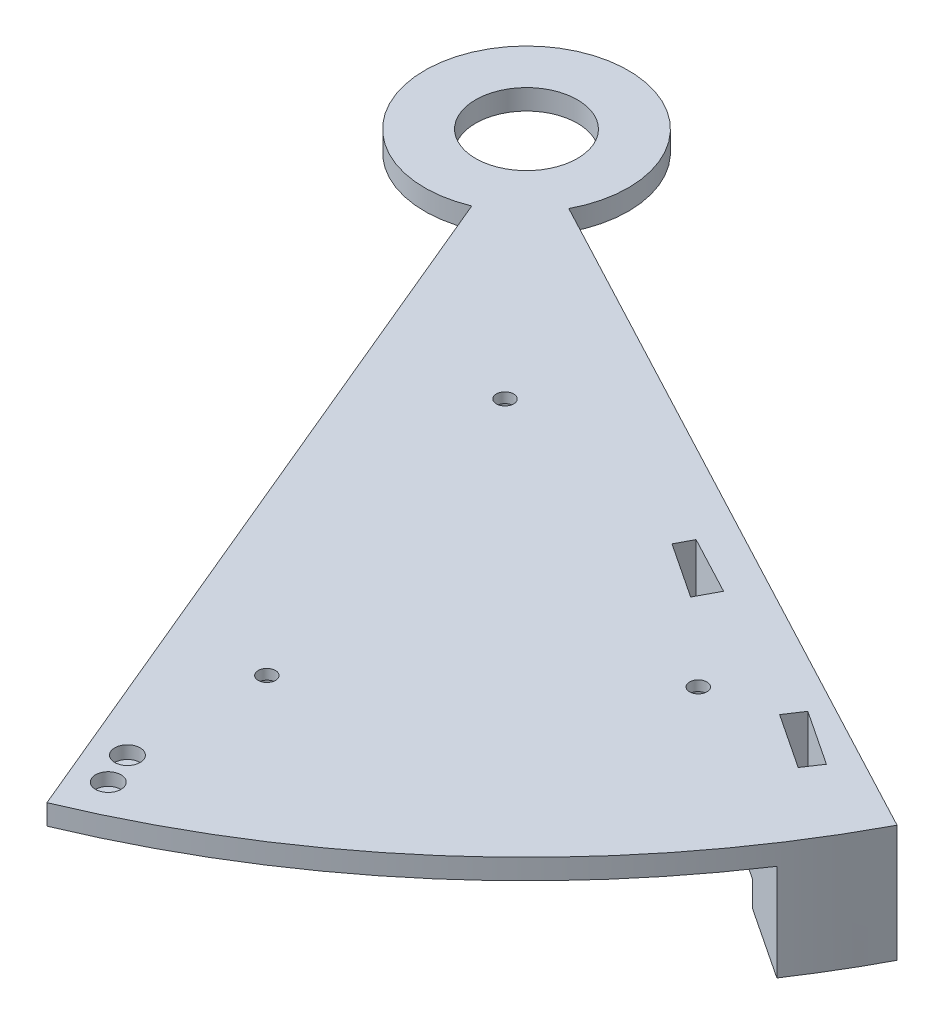
ISO-10303-21;
HEADER;
FILE_DESCRIPTION(('STEP AP214'),'2;1');
FILE_NAME('part.step','',(''),(''),'','','');
FILE_SCHEMA(('AUTOMOTIVE_DESIGN { 1 0 10303 214 1 1 1 1 }'));
ENDSEC;
DATA;
#1=APPLICATION_CONTEXT('core data for automotive mechanical design processes');
#2=APPLICATION_PROTOCOL_DEFINITION('international standard','automotive_design',2000,#1);
#3=PRODUCT_CONTEXT('',#1,'mechanical');
#4=PRODUCT('Part','Part','',(#3));
#5=PRODUCT_RELATED_PRODUCT_CATEGORY('part','',(#4));
#6=PRODUCT_DEFINITION_FORMATION('','',#4);
#7=PRODUCT_DEFINITION_CONTEXT('part definition',#1,'design');
#8=PRODUCT_DEFINITION('design','',#6,#7);
#9=PRODUCT_DEFINITION_SHAPE('','',#8);
#10=(LENGTH_UNIT() NAMED_UNIT(*) SI_UNIT(.MILLI.,.METRE.));
#11=(NAMED_UNIT(*) PLANE_ANGLE_UNIT() SI_UNIT($,.RADIAN.));
#12=(NAMED_UNIT(*) SI_UNIT($,.STERADIAN.) SOLID_ANGLE_UNIT());
#13=UNCERTAINTY_MEASURE_WITH_UNIT(LENGTH_MEASURE(1.E-05),#10,'distance_accuracy_value','');
#14=(GEOMETRIC_REPRESENTATION_CONTEXT(3) GLOBAL_UNCERTAINTY_ASSIGNED_CONTEXT((#13)) GLOBAL_UNIT_ASSIGNED_CONTEXT((#10,
#11,#12)) REPRESENTATION_CONTEXT('',''));
#15=CARTESIAN_POINT('',(0.,0.,0.));
#16=DIRECTION('',(0.,0.,1.));
#17=DIRECTION('',(1.,0.,0.));
#18=AXIS2_PLACEMENT_3D('',#15,#16,#17);
#19=CARTESIAN_POINT('',(0.,-19.,0.));
#20=DIRECTION('',(0.,-1.,0.));
#21=DIRECTION('',(0.,0.,-1.));
#22=AXIS2_PLACEMENT_3D('',#19,#20,#21);
#23=PLANE('',#22);
#24=DIRECTION('',(0.833392984477163,0.,0.552680860374455));
#25=VECTOR('',#24,1.);
#26=CARTESIAN_POINT('',(5.80314903393181,-19.,-8.75062633701025));
#27=LINE('',#26,#25);
#28=CARTESIAN_POINT('',(126.70883079196,-19.,71.430341661069));
#29=VERTEX_POINT('',#28);
#30=CARTESIAN_POINT('',(137.542939590163,-19.,78.6151928459368));
#31=VERTEX_POINT('',#30);
#32=EDGE_CURVE('E205',#29,#31,#27,.T.);
#33=ORIENTED_EDGE('',*,*,#32,.F.);
#34=DIRECTION('',(0.552680860374454,0.,-0.833392984477163));
#35=VECTOR('',#34,1.);
#36=CARTESIAN_POINT('',(120.905681758028,-19.,80.1809679980791));
#37=LINE('',#36,#35);
#38=CARTESIAN_POINT('',(120.905681758028,-19.,80.1809679980791));
#39=VERTEX_POINT('',#38);
#40=EDGE_CURVE('E188',#39,#29,#37,.T.);
#41=ORIENTED_EDGE('',*,*,#40,.F.);
#42=DIRECTION('',(0.833392984477163,0.,0.552680860374455));
#43=VECTOR('',#42,1.);
#44=CARTESIAN_POINT('',(0.,-19.,0.));
#45=LINE('',#44,#43);
#46=CARTESIAN_POINT('',(95.7592429864337,-19.,63.5046152155351));
#47=VERTEX_POINT('',#46);
#48=EDGE_CURVE('E370',#47,#39,#45,.T.);
#49=ORIENTED_EDGE('',*,*,#48,.F.);
#50=DIRECTION('',(-0.468176170110818,0.,0.883635147411174));
#51=VECTOR('',#50,1.);
#52=CARTESIAN_POINT('',(101.041540999482,-19.,53.5348122195286));
#53=LINE('',#52,#51);
#54=CARTESIAN_POINT('',(101.041540999482,-19.,53.5348122195284));
#55=VERTEX_POINT('',#54);
#56=EDGE_CURVE('E265',#55,#47,#53,.T.);
#57=ORIENTED_EDGE('',*,*,#56,.F.);
#58=DIRECTION('',(0.883635147411175,0.,0.468176170110816));
#59=VECTOR('',#58,1.);
#60=CARTESIAN_POINT('',(0.,-19.,0.));
#61=LINE('',#60,#59);
#62=CARTESIAN_POINT('',(154.857059583808,-19.,82.0478738119205));
#63=VERTEX_POINT('',#62);
#64=EDGE_CURVE('E354',#55,#63,#61,.T.);
#65=ORIENTED_EDGE('',*,*,#64,.T.);
#66=CARTESIAN_POINT('',(0.,-19.,0.));
#67=DIRECTION('',(0.,-1.,0.));
#68=DIRECTION('',(0.,0.,-1.));
#69=AXIS2_PLACEMENT_3D('',#66,#67,#68);
#70=CIRCLE('',#69,175.25);
#71=CARTESIAN_POINT('',(146.052120529623,-19.,96.8573207806232));
#72=VERTEX_POINT('',#71);
#73=EDGE_CURVE('E360',#63,#72,#70,.T.);
#74=ORIENTED_EDGE('',*,*,#73,.T.);
#75=CARTESIAN_POINT('',(131.739790556231,-19.,87.3658191829471));
#76=VERTEX_POINT('',#75);
#77=EDGE_CURVE('E364',#76,#72,#45,.T.);
#78=ORIENTED_EDGE('',*,*,#77,.F.);
#79=DIRECTION('',(0.552680860374456,0.,-0.833392984477162));
#80=VECTOR('',#79,1.);
#81=CARTESIAN_POINT('',(131.739790556231,-19.,87.3658191829473));
#82=LINE('',#81,#80);
#83=EDGE_CURVE('E217',#76,#31,#82,.T.);
#84=ORIENTED_EDGE('',*,*,#83,.T.);
#85=EDGE_LOOP('',(#33,#41,#49,#57,#65,#74,#78,#84));
#86=FACE_BOUND('',#85,.T.);
#87=ADVANCED_FACE('F41',(#86),#23,.T.);
#88=CARTESIAN_POINT('',(-3.04314510572033,4.,5.7436284581727));
#89=DIRECTION('',(0.468176170110815,0.,-0.883635147411175));
#90=DIRECTION('',(-0.883635147411175,0.,-0.468176170110815));
#91=AXIS2_PLACEMENT_3D('',#88,#89,#90);
#92=PLANE('',#91);
#93=DIRECTION('',(0.883635147411175,0.,0.468176170110815));
#94=VECTOR('',#93,1.);
#95=CARTESIAN_POINT('',(-3.04314510572033,-14.,5.7436284581727));
#96=LINE('',#95,#94);
#97=CARTESIAN_POINT('',(86.5111389774166,-14.,53.1921504662605));
#98=VERTEX_POINT('',#97);
#99=CARTESIAN_POINT('',(97.9983958937618,-14.,59.278440677701));
#100=VERTEX_POINT('',#99);
#101=EDGE_CURVE('E243',#98,#100,#96,.T.);
#102=ORIENTED_EDGE('',*,*,#101,.T.);
#103=DIRECTION('',(0.,-1.,0.));
#104=VECTOR('',#103,1.);
#105=CARTESIAN_POINT('',(97.9983958937618,4.,59.278440677701));
#106=LINE('',#105,#104);
#107=CARTESIAN_POINT('',(97.9983958937618,4.,59.278440677701));
#108=VERTEX_POINT('',#107);
#109=EDGE_CURVE('E291',#108,#100,#106,.T.);
#110=ORIENTED_EDGE('',*,*,#109,.F.);
#111=DIRECTION('',(0.883635147411175,0.,0.468176170110815));
#112=VECTOR('',#111,1.);
#113=CARTESIAN_POINT('',(-3.04314510572033,4.,5.7436284581727));
#114=LINE('',#113,#112);
#115=CARTESIAN_POINT('',(86.5111389774166,4.,53.1921504662605));
#116=VERTEX_POINT('',#115);
#117=EDGE_CURVE('E282',#116,#108,#114,.T.);
#118=ORIENTED_EDGE('',*,*,#117,.F.);
#119=DIRECTION('',(0.,-1.,0.));
#120=VECTOR('',#119,1.);
#121=CARTESIAN_POINT('',(86.5111389774166,4.,53.1921504662605));
#122=LINE('',#121,#120);
#123=EDGE_CURVE('E296',#116,#98,#122,.T.);
#124=ORIENTED_EDGE('',*,*,#123,.T.);
#125=EDGE_LOOP('',(#102,#110,#118,#124));
#126=FACE_BOUND('',#125,.T.);
#127=ADVANCED_FACE('F487',(#126),#92,.F.);
#128=CARTESIAN_POINT('',(0.,-19.,0.));
#129=DIRECTION('',(-0.552680860374455,0.,0.833392984477163));
#130=DIRECTION('',(0.833392984477163,0.,0.552680860374455));
#131=AXIS2_PLACEMENT_3D('',#128,#129,#130);
#132=PLANE('',#131);
#133=DIRECTION('',(0.,-1.,0.));
#134=VECTOR('',#133,1.);
#135=CARTESIAN_POINT('',(120.905681758028,-14.,80.1809679980791));
#136=LINE('',#135,#134);
#137=CARTESIAN_POINT('',(120.905681758028,-14.,80.1809679980791));
#138=VERTEX_POINT('',#137);
#139=EDGE_CURVE('E240',#138,#39,#136,.T.);
#140=ORIENTED_EDGE('',*,*,#139,.F.);
#141=DIRECTION('',(-0.833392984477163,0.,-0.552680860374455));
#142=VECTOR('',#141,1.);
#143=CARTESIAN_POINT('',(0.,-14.,0.));
#144=LINE('',#143,#142);
#145=CARTESIAN_POINT('',(131.739790556231,-14.,87.365819182947));
#146=VERTEX_POINT('',#145);
#147=EDGE_CURVE('E228',#146,#138,#144,.T.);
#148=ORIENTED_EDGE('',*,*,#147,.F.);
#149=DIRECTION('',(0.,-1.,0.));
#150=VECTOR('',#149,1.);
#151=CARTESIAN_POINT('',(131.739790556231,-14.,87.3658191829471));
#152=LINE('',#151,#150);
#153=EDGE_CURVE('E235',#146,#76,#152,.T.);
#154=ORIENTED_EDGE('',*,*,#153,.T.);
#155=ORIENTED_EDGE('',*,*,#77,.T.);
#156=DIRECTION('',(0.,1.,0.));
#157=VECTOR('',#156,1.);
#158=CARTESIAN_POINT('',(146.052120529623,-19.,96.8573207806232));
#159=LINE('',#158,#157);
#160=CARTESIAN_POINT('',(146.052120529623,0.,96.8573207806232));
#161=VERTEX_POINT('',#160);
#162=EDGE_CURVE('E380',#72,#161,#159,.T.);
#163=ORIENTED_EDGE('',*,*,#162,.T.);
#164=DIRECTION('',(0.833392984477163,0.,0.552680860374455));
#165=VECTOR('',#164,1.);
#166=CARTESIAN_POINT('',(0.,0.,0.));
#167=LINE('',#166,#165);
#168=CARTESIAN_POINT('',(95.7592429864337,0.,63.5046152155351));
#169=VERTEX_POINT('',#168);
#170=EDGE_CURVE('E374',#169,#161,#167,.T.);
#171=ORIENTED_EDGE('',*,*,#170,.F.);
#172=DIRECTION('',(0.,-1.,0.));
#173=VECTOR('',#172,1.);
#174=CARTESIAN_POINT('',(95.7592429864337,4.,63.5046152155351));
#175=LINE('',#174,#173);
#176=EDGE_CURVE('E286',#169,#47,#175,.T.);
#177=ORIENTED_EDGE('',*,*,#176,.T.);
#178=ORIENTED_EDGE('',*,*,#48,.T.);
#179=EDGE_LOOP('',(#140,#148,#154,#155,#163,#171,#177,#178));
#180=FACE_BOUND('',#179,.T.);
#181=ADVANCED_FACE('F477',(#180),#132,.T.);
#182=CARTESIAN_POINT('',(67.4644149722506,10.,118.480178563555));
#183=DIRECTION('',(0.,-1.,0.));
#184=DIRECTION('',(0.,0.,-1.));
#185=AXIS2_PLACEMENT_3D('',#182,#183,#184);
#186=CYLINDRICAL_SURFACE('',#185,1.7);
#187=CARTESIAN_POINT('',(67.4644149722506,4.,118.480178563555));
#188=DIRECTION('',(0.,1.,0.));
#189=DIRECTION('',(0.,0.,1.));
#190=AXIS2_PLACEMENT_3D('',#187,#188,#189);
#191=CIRCLE('',#190,1.7);
#192=CARTESIAN_POINT('',(67.4644149722506,4.,120.180178563555));
#193=VERTEX_POINT('',#192);
#194=EDGE_CURVE('E337',#193,#193,#191,.T.);
#195=ORIENTED_EDGE('',*,*,#194,.T.);
#196=EDGE_LOOP('',(#195));
#197=FACE_BOUND('',#196,.T.);
#198=CARTESIAN_POINT('',(67.4644149722506,2.,118.480178563555));
#199=DIRECTION('',(0.,-1.,0.));
#200=DIRECTION('',(0.,0.,-1.));
#201=AXIS2_PLACEMENT_3D('',#198,#199,#200);
#202=CIRCLE('',#201,1.7);
#203=CARTESIAN_POINT('',(67.4644149722506,2.,116.780178563555));
#204=VERTEX_POINT('',#203);
#205=EDGE_CURVE('E45',#204,#204,#202,.F.);
#206=ORIENTED_EDGE('',*,*,#205,.F.);
#207=EDGE_LOOP('',(#206));
#208=FACE_BOUND('',#207,.T.);
#209=ADVANCED_FACE('F474',(#197,#208),#186,.F.);
#210=CARTESIAN_POINT('',(111.793635370719,10.,78.0460318696525));
#211=DIRECTION('',(0.,-1.,0.));
#212=DIRECTION('',(0.,0.,-1.));
#213=AXIS2_PLACEMENT_3D('',#210,#211,#212);
#214=CYLINDRICAL_SURFACE('',#213,1.7);
#215=CARTESIAN_POINT('',(111.793635370719,4.,78.0460318696525));
#216=DIRECTION('',(0.,1.,0.));
#217=DIRECTION('',(0.,0.,1.));
#218=AXIS2_PLACEMENT_3D('',#215,#216,#217);
#219=CIRCLE('',#218,1.7);
#220=CARTESIAN_POINT('',(111.793635370719,4.,79.7460318696525));
#221=VERTEX_POINT('',#220);
#222=EDGE_CURVE('E341',#221,#221,#219,.T.);
#223=ORIENTED_EDGE('',*,*,#222,.T.);
#224=EDGE_LOOP('',(#223));
#225=FACE_BOUND('',#224,.T.);
#226=CARTESIAN_POINT('',(111.793635370719,2.,78.0460318696525));
#227=DIRECTION('',(0.,-1.,0.));
#228=DIRECTION('',(0.,0.,-1.));
#229=AXIS2_PLACEMENT_3D('',#226,#227,#228);
#230=CIRCLE('',#229,1.7);
#231=CARTESIAN_POINT('',(111.793635370719,2.,76.3460318696525));
#232=VERTEX_POINT('',#231);
#233=EDGE_CURVE('E463',#232,#232,#230,.F.);
#234=ORIENTED_EDGE('',*,*,#233,.F.);
#235=EDGE_LOOP('',(#234));
#236=FACE_BOUND('',#235,.T.);
#237=ADVANCED_FACE('F476',(#225,#236),#214,.F.);
#238=CARTESIAN_POINT('',(43.8036589183947,10.,48.0233220983403));
#239=DIRECTION('',(0.,-1.,0.));
#240=DIRECTION('',(0.,0.,-1.));
#241=AXIS2_PLACEMENT_3D('',#238,#239,#240);
#242=CYLINDRICAL_SURFACE('',#241,1.7);
#243=CARTESIAN_POINT('',(43.8036589183947,4.,48.0233220983403));
#244=DIRECTION('',(0.,1.,0.));
#245=DIRECTION('',(0.,0.,1.));
#246=AXIS2_PLACEMENT_3D('',#243,#244,#245);
#247=CIRCLE('',#246,1.7);
#248=CARTESIAN_POINT('',(43.8036589183947,4.,49.7233220983403));
#249=VERTEX_POINT('',#248);
#250=EDGE_CURVE('E345',#249,#249,#247,.T.);
#251=ORIENTED_EDGE('',*,*,#250,.T.);
#252=EDGE_LOOP('',(#251));
#253=FACE_BOUND('',#252,.T.);
#254=CARTESIAN_POINT('',(43.8036589183947,2.,48.0233220983403));
#255=DIRECTION('',(0.,-1.,0.));
#256=DIRECTION('',(0.,0.,-1.));
#257=AXIS2_PLACEMENT_3D('',#254,#255,#256);
#258=CIRCLE('',#257,1.7);
#259=CARTESIAN_POINT('',(43.8036589183947,2.,46.3233220983403));
#260=VERTEX_POINT('',#259);
#261=EDGE_CURVE('E317',#260,#260,#258,.F.);
#262=ORIENTED_EDGE('',*,*,#261,.F.);
#263=EDGE_LOOP('',(#262));
#264=FACE_BOUND('',#263,.T.);
#265=ADVANCED_FACE('F484',(#253,#264),#242,.F.);
#266=CARTESIAN_POINT('',(0.,4.,0.));
#267=DIRECTION('',(0.,-1.,0.));
#268=DIRECTION('',(0.,0.,-1.));
#269=AXIS2_PLACEMENT_3D('',#266,#267,#268);
#270=CYLINDRICAL_SURFACE('',#269,175.25);
#271=CARTESIAN_POINT('',(0.,0.,0.));
#272=DIRECTION('',(0.,1.,0.));
#273=DIRECTION('',(0.,0.,1.));
#274=AXIS2_PLACEMENT_3D('',#271,#272,#273);
#275=CIRCLE('',#274,175.25);
#276=CARTESIAN_POINT('',(67.5000025728551,0.,161.729132046965));
#277=VERTEX_POINT('',#276);
#278=EDGE_CURVE('E408',#277,#161,#275,.T.);
#279=ORIENTED_EDGE('',*,*,#278,.T.);
#280=ORIENTED_EDGE('',*,*,#162,.F.);
#281=ORIENTED_EDGE('',*,*,#73,.F.);
#282=DIRECTION('',(0.,-1.,0.));
#283=VECTOR('',#282,1.);
#284=CARTESIAN_POINT('',(154.857059583808,4.,82.0478738119205));
#285=LINE('',#284,#283);
#286=CARTESIAN_POINT('',(154.857059583808,4.,82.0478738119205));
#287=VERTEX_POINT('',#286);
#288=EDGE_CURVE('E11',#287,#63,#285,.T.);
#289=ORIENTED_EDGE('',*,*,#288,.F.);
#290=CARTESIAN_POINT('',(0.,4.,0.));
#291=DIRECTION('',(0.,1.,0.));
#292=DIRECTION('',(0.,0.,1.));
#293=AXIS2_PLACEMENT_3D('',#290,#291,#292);
#294=CIRCLE('',#293,175.25);
#295=CARTESIAN_POINT('',(67.5000025728551,4.,161.729132046965));
#296=VERTEX_POINT('',#295);
#297=EDGE_CURVE('E422',#296,#287,#294,.T.);
#298=ORIENTED_EDGE('',*,*,#297,.F.);
#299=DIRECTION('',(0.,-1.,0.));
#300=VECTOR('',#299,1.);
#301=CARTESIAN_POINT('',(67.5000025728551,4.,161.729132046965));
#302=LINE('',#301,#300);
#303=EDGE_CURVE('E436',#296,#277,#302,.T.);
#304=ORIENTED_EDGE('',*,*,#303,.T.);
#305=EDGE_LOOP('',(#279,#280,#281,#289,#298,#304));
#306=FACE_BOUND('',#305,.T.);
#307=ADVANCED_FACE('F43',(#306),#270,.T.);
#308=CARTESIAN_POINT('',(17.6727029482235,4.,9.36352340221632));
#309=DIRECTION('',(-0.468176170110816,0.,0.883635147411175));
#310=DIRECTION('',(0.883635147411175,0.,0.468176170110816));
#311=AXIS2_PLACEMENT_3D('',#308,#309,#310);
#312=PLANE('',#311);
#313=ORIENTED_EDGE('',*,*,#64,.F.);
#314=DIRECTION('',(0.,-1.,0.));
#315=VECTOR('',#314,1.);
#316=CARTESIAN_POINT('',(101.041540999482,-14.,53.5348122195284));
#317=LINE('',#316,#315);
#318=CARTESIAN_POINT('',(101.041540999482,-14.,53.5348122195284));
#319=VERTEX_POINT('',#318);
#320=EDGE_CURVE('E261',#319,#55,#317,.T.);
#321=ORIENTED_EDGE('',*,*,#320,.F.);
#322=DIRECTION('',(0.883635147411175,0.,0.468176170110816));
#323=VECTOR('',#322,1.);
#324=CARTESIAN_POINT('',(0.,-14.,0.));
#325=LINE('',#324,#323);
#326=CARTESIAN_POINT('',(89.5542840831369,-14.,47.4485220080878));
#327=VERTEX_POINT('',#326);
#328=EDGE_CURVE('E254',#327,#319,#325,.T.);
#329=ORIENTED_EDGE('',*,*,#328,.F.);
#330=DIRECTION('',(0.,-1.,0.));
#331=VECTOR('',#330,1.);
#332=CARTESIAN_POINT('',(89.5542840831369,-14.,47.4485220080878));
#333=LINE('',#332,#331);
#334=CARTESIAN_POINT('',(89.5542840831369,-19.,47.4485220080878));
#335=VERTEX_POINT('',#334);
#336=EDGE_CURVE('E260',#327,#335,#333,.T.);
#337=ORIENTED_EDGE('',*,*,#336,.T.);
#338=CARTESIAN_POINT('',(17.6727029482235,-19.,9.36352340221632));
#339=VERTEX_POINT('',#338);
#340=EDGE_CURVE('E356',#339,#335,#61,.T.);
#341=ORIENTED_EDGE('',*,*,#340,.F.);
#342=DIRECTION('',(0.,1.,0.));
#343=VECTOR('',#342,1.);
#344=CARTESIAN_POINT('',(17.6727029482235,-19.,9.36352340221632));
#345=LINE('',#344,#343);
#346=CARTESIAN_POINT('',(17.6727029482235,0.,9.36352340221632));
#347=VERTEX_POINT('',#346);
#348=EDGE_CURVE('E384',#339,#347,#345,.T.);
#349=ORIENTED_EDGE('',*,*,#348,.T.);
#350=DIRECTION('',(0.,-1.,0.));
#351=VECTOR('',#350,1.);
#352=CARTESIAN_POINT('',(17.6727029482235,4.,9.36352340221632));
#353=LINE('',#352,#351);
#354=CARTESIAN_POINT('',(17.6727029482235,4.,9.36352340221632));
#355=VERTEX_POINT('',#354);
#356=EDGE_CURVE('E51',#355,#347,#353,.T.);
#357=ORIENTED_EDGE('',*,*,#356,.F.);
#358=DIRECTION('',(-0.883635147411175,0.,-0.468176170110816));
#359=VECTOR('',#358,1.);
#360=CARTESIAN_POINT('',(17.6727029482235,4.,9.36352340221632));
#361=LINE('',#360,#359);
#362=EDGE_CURVE('E426',#287,#355,#361,.T.);
#363=ORIENTED_EDGE('',*,*,#362,.F.);
#364=ORIENTED_EDGE('',*,*,#288,.T.);
#365=EDGE_LOOP('',(#313,#321,#329,#337,#341,#349,#357,#363,#364));
#366=FACE_BOUND('',#365,.T.);
#367=ADVANCED_FACE('F519',(#366),#312,.F.);
#368=CARTESIAN_POINT('',(0.,4.,0.));
#369=DIRECTION('',(0.,-1.,0.));
#370=DIRECTION('',(0.,0.,-1.));
#371=AXIS2_PLACEMENT_3D('',#368,#369,#370);
#372=CYLINDRICAL_SURFACE('',#371,20.);
#373=CARTESIAN_POINT('',(0.,0.,0.));
#374=DIRECTION('',(0.,1.,0.));
#375=DIRECTION('',(0.,0.,1.));
#376=AXIS2_PLACEMENT_3D('',#373,#374,#375);
#377=CIRCLE('',#376,20.);
#378=CARTESIAN_POINT('',(7.70328132072526,0.,18.4569622878134));
#379=VERTEX_POINT('',#378);
#380=EDGE_CURVE('E440',#347,#379,#377,.T.);
#381=ORIENTED_EDGE('',*,*,#380,.T.);
#382=DIRECTION('',(0.,-1.,0.));
#383=VECTOR('',#382,1.);
#384=CARTESIAN_POINT('',(7.70328132072526,4.,18.4569622878134));
#385=LINE('',#384,#383);
#386=CARTESIAN_POINT('',(7.70328132072526,4.,18.4569622878134));
#387=VERTEX_POINT('',#386);
#388=EDGE_CURVE('E448',#387,#379,#385,.T.);
#389=ORIENTED_EDGE('',*,*,#388,.F.);
#390=CARTESIAN_POINT('',(0.,4.,0.));
#391=DIRECTION('',(0.,1.,0.));
#392=DIRECTION('',(0.,0.,1.));
#393=AXIS2_PLACEMENT_3D('',#390,#391,#392);
#394=CIRCLE('',#393,20.);
#395=EDGE_CURVE('E430',#355,#387,#394,.T.);
#396=ORIENTED_EDGE('',*,*,#395,.F.);
#397=ORIENTED_EDGE('',*,*,#356,.T.);
#398=EDGE_LOOP('',(#381,#389,#396,#397));
#399=FACE_BOUND('',#398,.T.);
#400=ADVANCED_FACE('F557',(#399),#372,.T.);
#401=CARTESIAN_POINT('',(67.5000025728551,4.,161.729132046965));
#402=DIRECTION('',(0.922848114390669,0.,-0.385164066036263));
#403=DIRECTION('',(-0.385164066036263,0.,-0.922848114390669));
#404=AXIS2_PLACEMENT_3D('',#401,#402,#403);
#405=PLANE('',#404);
#406=DIRECTION('',(0.385164066036263,0.,0.922848114390669));
#407=VECTOR('',#406,1.);
#408=CARTESIAN_POINT('',(67.5000025728551,0.,161.729132046965));
#409=LINE('',#408,#407);
#410=EDGE_CURVE('E427',#379,#277,#409,.T.);
#411=ORIENTED_EDGE('',*,*,#410,.T.);
#412=ORIENTED_EDGE('',*,*,#303,.F.);
#413=DIRECTION('',(0.385164066036263,0.,0.922848114390669));
#414=VECTOR('',#413,1.);
#415=CARTESIAN_POINT('',(67.5000025728551,4.,161.729132046965));
#416=LINE('',#415,#414);
#417=EDGE_CURVE('E433',#387,#296,#416,.T.);
#418=ORIENTED_EDGE('',*,*,#417,.F.);
#419=ORIENTED_EDGE('',*,*,#388,.T.);
#420=EDGE_LOOP('',(#411,#412,#418,#419));
#421=FACE_BOUND('',#420,.T.);
#422=ADVANCED_FACE('F562',(#421),#405,.F.);
#423=CARTESIAN_POINT('',(0.,4.,0.));
#424=DIRECTION('',(0.,1.,0.));
#425=DIRECTION('',(0.,0.,1.));
#426=AXIS2_PLACEMENT_3D('',#423,#424,#425);
#427=PLANE('',#426);
#428=DIRECTION('',(0.552680860374453,0.,-0.833392984477164));
#429=VECTOR('',#428,1.);
#430=CARTESIAN_POINT('',(120.905681758028,4.,80.180967998079));
#431=LINE('',#430,#429);
#432=CARTESIAN_POINT('',(124.498107350462,4.,74.7639135989776));
#433=VERTEX_POINT('',#432);
#434=CARTESIAN_POINT('',(126.70883079196,4.,71.430341661069));
#435=VERTEX_POINT('',#434);
#436=EDGE_CURVE('E185',#433,#435,#431,.T.);
#437=ORIENTED_EDGE('',*,*,#436,.T.);
#438=DIRECTION('',(0.833392984477163,0.,0.552680860374455));
#439=VECTOR('',#438,1.);
#440=CARTESIAN_POINT('',(5.80314903393181,4.,-8.75062633701025));
#441=LINE('',#440,#439);
#442=CARTESIAN_POINT('',(137.542939590163,4.,78.6151928459368));
#443=VERTEX_POINT('',#442);
#444=EDGE_CURVE('E194',#435,#443,#441,.T.);
#445=ORIENTED_EDGE('',*,*,#444,.T.);
#446=DIRECTION('',(0.552680860374449,0.,-0.833392984477167));
#447=VECTOR('',#446,1.);
#448=CARTESIAN_POINT('',(131.739790556232,4.,87.3658191829461));
#449=LINE('',#448,#447);
#450=CARTESIAN_POINT('',(135.332216148665,4.,81.9487647838455));
#451=VERTEX_POINT('',#450);
#452=EDGE_CURVE('E199',#451,#443,#449,.T.);
#453=ORIENTED_EDGE('',*,*,#452,.F.);
#454=DIRECTION('',(-0.833392984477163,0.,-0.552680860374454));
#455=VECTOR('',#454,1.);
#456=CARTESIAN_POINT('',(3.59242559243389,4.,-5.41705439910147));
#457=LINE('',#456,#455);
#458=EDGE_CURVE('E191',#451,#433,#457,.T.);
#459=ORIENTED_EDGE('',*,*,#458,.T.);
#460=EDGE_LOOP('',(#437,#445,#453,#459));
#461=FACE_BOUND('',#460,.T.);
#462=DIRECTION('',(-0.468176170110818,0.,0.883635147411174));
#463=VECTOR('',#462,1.);
#464=CARTESIAN_POINT('',(101.041540999482,4.,53.5348122195286));
#465=LINE('',#464,#463);
#466=CARTESIAN_POINT('',(95.7592429864337,4.,63.5046152155351));
#467=VERTEX_POINT('',#466);
#468=EDGE_CURVE('E269',#108,#467,#465,.T.);
#469=ORIENTED_EDGE('',*,*,#468,.T.);
#470=DIRECTION('',(-0.833392984477163,0.,-0.552680860374455));
#471=VECTOR('',#470,1.);
#472=CARTESIAN_POINT('',(0.,4.,0.));
#473=LINE('',#472,#471);
#474=CARTESIAN_POINT('',(84.8725223820288,4.,56.2848734821996));
#475=VERTEX_POINT('',#474);
#476=EDGE_CURVE('E273',#467,#475,#473,.T.);
#477=ORIENTED_EDGE('',*,*,#476,.T.);
#478=DIRECTION('',(0.468176170110815,0.,-0.883635147411175));
#479=VECTOR('',#478,1.);
#480=CARTESIAN_POINT('',(89.554284083137,4.,47.4485220080877));
#481=LINE('',#480,#479);
#482=EDGE_CURVE('E278',#475,#116,#481,.T.);
#483=ORIENTED_EDGE('',*,*,#482,.T.);
#484=ORIENTED_EDGE('',*,*,#117,.T.);
#485=EDGE_LOOP('',(#469,#477,#483,#484));
#486=FACE_BOUND('',#485,.T.);
#487=ORIENTED_EDGE('',*,*,#250,.F.);
#488=EDGE_LOOP('',(#487));
#489=FACE_BOUND('',#488,.T.);
#490=ORIENTED_EDGE('',*,*,#222,.F.);
#491=EDGE_LOOP('',(#490));
#492=FACE_BOUND('',#491,.T.);
#493=ORIENTED_EDGE('',*,*,#194,.F.);
#494=EDGE_LOOP('',(#493));
#495=FACE_BOUND('',#494,.T.);
#496=CARTESIAN_POINT('',(0.,4.,0.));
#497=DIRECTION('',(0.,1.,0.));
#498=DIRECTION('',(0.,0.,1.));
#499=AXIS2_PLACEMENT_3D('',#496,#497,#498);
#500=CIRCLE('',#499,10.);
#501=CARTESIAN_POINT('',(0.,4.,10.));
#502=VERTEX_POINT('',#501);
#503=EDGE_CURVE('E387',#502,#502,#500,.T.);
#504=ORIENTED_EDGE('',*,*,#503,.F.);
#505=EDGE_LOOP('',(#504));
#506=FACE_BOUND('',#505,.T.);
#507=CARTESIAN_POINT('',(70.0252076744945,4.,152.20421114458));
#508=DIRECTION('',(0.,1.,0.));
#509=DIRECTION('',(0.,0.,-1.));
#510=AXIS2_PLACEMENT_3D('',#507,#508,#509);
#511=CIRCLE('',#510,2.49999999999998);
#512=CARTESIAN_POINT('',(70.0252076744945,4.,149.70421114458));
#513=VERTEX_POINT('',#512);
#514=EDGE_CURVE('E409',#513,#513,#511,.T.);
#515=ORIENTED_EDGE('',*,*,#514,.F.);
#516=EDGE_LOOP('',(#515));
#517=FACE_BOUND('',#516,.T.);
#518=CARTESIAN_POINT('',(67.3271757764404,4.,145.739984225223));
#519=DIRECTION('',(0.,1.,0.));
#520=DIRECTION('',(0.,0.,-1.));
#521=AXIS2_PLACEMENT_3D('',#518,#519,#520);
#522=CIRCLE('',#521,2.50000000000001);
#523=CARTESIAN_POINT('',(67.3271757764404,4.,143.239984225223));
#524=VERTEX_POINT('',#523);
#525=EDGE_CURVE('E417',#524,#524,#522,.T.);
#526=ORIENTED_EDGE('',*,*,#525,.F.);
#527=EDGE_LOOP('',(#526));
#528=FACE_BOUND('',#527,.T.);
#529=ORIENTED_EDGE('',*,*,#297,.T.);
#530=ORIENTED_EDGE('',*,*,#362,.T.);
#531=ORIENTED_EDGE('',*,*,#395,.T.);
#532=ORIENTED_EDGE('',*,*,#417,.T.);
#533=EDGE_LOOP('',(#529,#530,#531,#532));
#534=FACE_BOUND('',#533,.T.);
#535=ADVANCED_FACE('F201',(#461,#486,#489,#492,#495,#506,#517,#528,#534),#427,.T.);
#536=CARTESIAN_POINT('',(0.,0.,0.));
#537=DIRECTION('',(0.,1.,0.));
#538=DIRECTION('',(0.,0.,1.));
#539=AXIS2_PLACEMENT_3D('',#536,#537,#538);
#540=PLANE('',#539);
#541=CARTESIAN_POINT('',(111.793635370719,0.,78.0460318696525));
#542=DIRECTION('',(0.,-1.,0.));
#543=DIRECTION('',(0.,0.,-1.));
#544=AXIS2_PLACEMENT_3D('',#541,#542,#543);
#545=CIRCLE('',#544,3.00000000000001);
#546=CARTESIAN_POINT('',(111.793635370719,0.,75.0460318696525));
#547=VERTEX_POINT('',#546);
#548=EDGE_CURVE('E318',#547,#547,#545,.T.);
#549=ORIENTED_EDGE('',*,*,#548,.F.);
#550=EDGE_LOOP('',(#549));
#551=FACE_BOUND('',#550,.T.);
#552=CARTESIAN_POINT('',(43.8036589183947,0.,48.0233220983403));
#553=DIRECTION('',(0.,-1.,0.));
#554=DIRECTION('',(0.,0.,-1.));
#555=AXIS2_PLACEMENT_3D('',#552,#553,#554);
#556=CIRCLE('',#555,3.);
#557=CARTESIAN_POINT('',(43.8036589183947,0.,45.0233220983403));
#558=VERTEX_POINT('',#557);
#559=EDGE_CURVE('E326',#558,#558,#556,.T.);
#560=ORIENTED_EDGE('',*,*,#559,.F.);
#561=EDGE_LOOP('',(#560));
#562=FACE_BOUND('',#561,.T.);
#563=CARTESIAN_POINT('',(67.4644149722506,0.,118.480178563555));
#564=DIRECTION('',(0.,-1.,0.));
#565=DIRECTION('',(0.,0.,-1.));
#566=AXIS2_PLACEMENT_3D('',#563,#564,#565);
#567=CIRCLE('',#566,3.00000000000001);
#568=CARTESIAN_POINT('',(67.4644149722506,0.,115.480178563555));
#569=VERTEX_POINT('',#568);
#570=EDGE_CURVE('E312',#569,#569,#567,.T.);
#571=ORIENTED_EDGE('',*,*,#570,.F.);
#572=EDGE_LOOP('',(#571));
#573=FACE_BOUND('',#572,.T.);
#574=CARTESIAN_POINT('',(0.,0.,0.));
#575=DIRECTION('',(0.,1.,0.));
#576=DIRECTION('',(0.,0.,1.));
#577=AXIS2_PLACEMENT_3D('',#574,#575,#576);
#578=CIRCLE('',#577,10.);
#579=CARTESIAN_POINT('',(0.,0.,10.));
#580=VERTEX_POINT('',#579);
#581=EDGE_CURVE('E388',#580,#580,#578,.T.);
#582=ORIENTED_EDGE('',*,*,#581,.T.);
#583=EDGE_LOOP('',(#582));
#584=FACE_BOUND('',#583,.T.);
#585=CARTESIAN_POINT('',(70.0252076744945,0.,152.20421114458));
#586=DIRECTION('',(0.,1.,0.));
#587=DIRECTION('',(0.,0.,-1.));
#588=AXIS2_PLACEMENT_3D('',#585,#586,#587);
#589=CIRCLE('',#588,0.750000000000012);
#590=CARTESIAN_POINT('',(70.0252076744945,0.,151.45421114458));
#591=VERTEX_POINT('',#590);
#592=EDGE_CURVE('E396',#591,#591,#589,.T.);
#593=ORIENTED_EDGE('',*,*,#592,.T.);
#594=EDGE_LOOP('',(#593));
#595=FACE_BOUND('',#594,.T.);
#596=CARTESIAN_POINT('',(67.3271757764404,0.,145.739984225223));
#597=DIRECTION('',(0.,1.,0.));
#598=DIRECTION('',(0.,0.,-1.));
#599=AXIS2_PLACEMENT_3D('',#596,#597,#598);
#600=CIRCLE('',#599,0.750000000000012);
#601=CARTESIAN_POINT('',(67.3271757764404,0.,144.989984225223));
#602=VERTEX_POINT('',#601);
#603=EDGE_CURVE('E392',#602,#602,#600,.T.);
#604=ORIENTED_EDGE('',*,*,#603,.T.);
#605=EDGE_LOOP('',(#604));
#606=FACE_BOUND('',#605,.T.);
#607=ORIENTED_EDGE('',*,*,#380,.F.);
#608=CARTESIAN_POINT('',(0.,0.,0.));
#609=DIRECTION('',(0.,-1.,0.));
#610=DIRECTION('',(0.,0.,-1.));
#611=AXIS2_PLACEMENT_3D('',#608,#609,#610);
#612=CIRCLE('',#611,20.);
#613=CARTESIAN_POINT('',(16.6678596895433,0.,11.0536172074891));
#614=VERTEX_POINT('',#613);
#615=EDGE_CURVE('E349',#347,#614,#612,.T.);
#616=ORIENTED_EDGE('',*,*,#615,.T.);
#617=CARTESIAN_POINT('',(84.8725223820288,0.,56.2848734821996));
#618=VERTEX_POINT('',#617);
#619=EDGE_CURVE('E355',#614,#618,#167,.T.);
#620=ORIENTED_EDGE('',*,*,#619,.T.);
#621=DIRECTION('',(0.833392984477163,0.,0.552680860374455));
#622=VECTOR('',#621,1.);
#623=CARTESIAN_POINT('',(0.,0.,0.));
#624=LINE('',#623,#622);
#625=EDGE_CURVE('E295',#618,#169,#624,.T.);
#626=ORIENTED_EDGE('',*,*,#625,.T.);
#627=ORIENTED_EDGE('',*,*,#170,.T.);
#628=ORIENTED_EDGE('',*,*,#278,.F.);
#629=ORIENTED_EDGE('',*,*,#410,.F.);
#630=EDGE_LOOP('',(#607,#616,#620,#626,#627,#628,#629));
#631=FACE_BOUND('',#630,.T.);
#632=ADVANCED_FACE('F550',(#551,#562,#573,#584,#595,#606,#631),#540,.F.);
#633=CARTESIAN_POINT('',(67.3271757764404,1.5,145.739984225223));
#634=DIRECTION('',(0.,1.,0.));
#635=DIRECTION('',(0.,0.,1.));
#636=AXIS2_PLACEMENT_3D('',#633,#634,#635);
#637=CYLINDRICAL_SURFACE('',#636,2.50000000000001);
#638=CARTESIAN_POINT('',(67.3271757764404,1.5,145.739984225223));
#639=DIRECTION('',(0.,1.,0.));
#640=DIRECTION('',(0.,0.,-1.));
#641=AXIS2_PLACEMENT_3D('',#638,#639,#640);
#642=CIRCLE('',#641,2.50000000000001);
#643=CARTESIAN_POINT('',(67.3271757764404,1.5,143.239984225223));
#644=VERTEX_POINT('',#643);
#645=EDGE_CURVE('E413',#644,#644,#642,.T.);
#646=ORIENTED_EDGE('',*,*,#645,.F.);
#647=EDGE_LOOP('',(#646));
#648=FACE_BOUND('',#647,.T.);
#649=ORIENTED_EDGE('',*,*,#525,.T.);
#650=EDGE_LOOP('',(#649));
#651=FACE_BOUND('',#650,.T.);
#652=ADVANCED_FACE('F640',(#648,#651),#637,.F.);
#653=CARTESIAN_POINT('',(67.3271757764404,1.5,145.739984225223));
#654=DIRECTION('',(0.,-1.,0.));
#655=DIRECTION('',(0.,0.,-1.));
#656=AXIS2_PLACEMENT_3D('',#653,#654,#655);
#657=PLANE('',#656);
#658=CARTESIAN_POINT('',(67.3271757764404,1.5,145.739984225223));
#659=DIRECTION('',(0.,-1.,0.));
#660=DIRECTION('',(0.,0.,-1.));
#661=AXIS2_PLACEMENT_3D('',#658,#659,#660);
#662=CIRCLE('',#661,0.750000000000012);
#663=CARTESIAN_POINT('',(67.3271757764404,1.5,144.989984225223));
#664=VERTEX_POINT('',#663);
#665=EDGE_CURVE('E421',#664,#664,#662,.T.);
#666=ORIENTED_EDGE('',*,*,#665,.T.);
#667=EDGE_LOOP('',(#666));
#668=FACE_BOUND('',#667,.T.);
#669=ORIENTED_EDGE('',*,*,#645,.T.);
#670=EDGE_LOOP('',(#669));
#671=FACE_BOUND('',#670,.T.);
#672=ADVANCED_FACE('F642',(#668,#671),#657,.F.);
#673=CARTESIAN_POINT('',(70.0252076744945,1.5,152.20421114458));
#674=DIRECTION('',(0.,1.,0.));
#675=DIRECTION('',(0.,0.,1.));
#676=AXIS2_PLACEMENT_3D('',#673,#674,#675);
#677=CYLINDRICAL_SURFACE('',#676,2.49999999999998);
#678=CARTESIAN_POINT('',(70.0252076744945,1.5,152.20421114458));
#679=DIRECTION('',(0.,1.,0.));
#680=DIRECTION('',(0.,0.,-1.));
#681=AXIS2_PLACEMENT_3D('',#678,#679,#680);
#682=CIRCLE('',#681,2.49999999999998);
#683=CARTESIAN_POINT('',(70.0252076744945,1.5,149.70421114458));
#684=VERTEX_POINT('',#683);
#685=EDGE_CURVE('E404',#684,#684,#682,.T.);
#686=ORIENTED_EDGE('',*,*,#685,.F.);
#687=EDGE_LOOP('',(#686));
#688=FACE_BOUND('',#687,.T.);
#689=ORIENTED_EDGE('',*,*,#514,.T.);
#690=EDGE_LOOP('',(#689));
#691=FACE_BOUND('',#690,.T.);
#692=ADVANCED_FACE('F649',(#688,#691),#677,.F.);
#693=CARTESIAN_POINT('',(70.0252076744945,1.5,152.20421114458));
#694=DIRECTION('',(0.,-1.,0.));
#695=DIRECTION('',(0.,0.,-1.));
#696=AXIS2_PLACEMENT_3D('',#693,#694,#695);
#697=PLANE('',#696);
#698=CARTESIAN_POINT('',(70.0252076744945,1.5,152.20421114458));
#699=DIRECTION('',(0.,-1.,0.));
#700=DIRECTION('',(0.,0.,-1.));
#701=AXIS2_PLACEMENT_3D('',#698,#699,#700);
#702=CIRCLE('',#701,0.750000000000012);
#703=CARTESIAN_POINT('',(70.0252076744945,1.5,151.45421114458));
#704=VERTEX_POINT('',#703);
#705=EDGE_CURVE('E400',#704,#704,#702,.T.);
#706=ORIENTED_EDGE('',*,*,#705,.T.);
#707=EDGE_LOOP('',(#706));
#708=FACE_BOUND('',#707,.T.);
#709=ORIENTED_EDGE('',*,*,#685,.T.);
#710=EDGE_LOOP('',(#709));
#711=FACE_BOUND('',#710,.T.);
#712=ADVANCED_FACE('F864',(#708,#711),#697,.F.);
#713=CARTESIAN_POINT('',(70.0252076744945,0.,152.20421114458));
#714=DIRECTION('',(0.,1.,0.));
#715=DIRECTION('',(0.,0.,1.));
#716=AXIS2_PLACEMENT_3D('',#713,#714,#715);
#717=CYLINDRICAL_SURFACE('',#716,0.750000000000012);
#718=ORIENTED_EDGE('',*,*,#592,.F.);
#719=EDGE_LOOP('',(#718));
#720=FACE_BOUND('',#719,.T.);
#721=ORIENTED_EDGE('',*,*,#705,.F.);
#722=EDGE_LOOP('',(#721));
#723=FACE_BOUND('',#722,.T.);
#724=ADVANCED_FACE('F878',(#720,#723),#717,.F.);
#725=CARTESIAN_POINT('',(67.3271757764404,0.,145.739984225223));
#726=DIRECTION('',(0.,1.,0.));
#727=DIRECTION('',(0.,0.,1.));
#728=AXIS2_PLACEMENT_3D('',#725,#726,#727);
#729=CYLINDRICAL_SURFACE('',#728,0.750000000000012);
#730=ORIENTED_EDGE('',*,*,#603,.F.);
#731=EDGE_LOOP('',(#730));
#732=FACE_BOUND('',#731,.T.);
#733=ORIENTED_EDGE('',*,*,#665,.F.);
#734=EDGE_LOOP('',(#733));
#735=FACE_BOUND('',#734,.T.);
#736=ADVANCED_FACE('F887',(#732,#735),#729,.F.);
#737=CARTESIAN_POINT('',(0.,0.,0.));
#738=DIRECTION('',(0.,1.,0.));
#739=DIRECTION('',(0.,0.,1.));
#740=AXIS2_PLACEMENT_3D('',#737,#738,#739);
#741=CYLINDRICAL_SURFACE('',#740,10.);
#742=ORIENTED_EDGE('',*,*,#581,.F.);
#743=EDGE_LOOP('',(#742));
#744=FACE_BOUND('',#743,.T.);
#745=ORIENTED_EDGE('',*,*,#503,.T.);
#746=EDGE_LOOP('',(#745));
#747=FACE_BOUND('',#746,.T.);
#748=ADVANCED_FACE('F675',(#744,#747),#741,.F.);
#749=CARTESIAN_POINT('',(0.,-19.,0.));
#750=DIRECTION('',(0.,1.,0.));
#751=DIRECTION('',(0.,0.,1.));
#752=AXIS2_PLACEMENT_3D('',#749,#750,#751);
#753=CYLINDRICAL_SURFACE('',#752,20.);
#754=ORIENTED_EDGE('',*,*,#615,.F.);
#755=ORIENTED_EDGE('',*,*,#348,.F.);
#756=CARTESIAN_POINT('',(0.,-19.,0.));
#757=DIRECTION('',(0.,-1.,0.));
#758=DIRECTION('',(0.,0.,-1.));
#759=AXIS2_PLACEMENT_3D('',#756,#757,#758);
#760=CIRCLE('',#759,20.);
#761=CARTESIAN_POINT('',(16.6678596895433,-19.,11.0536172074891));
#762=VERTEX_POINT('',#761);
#763=EDGE_CURVE('E350',#339,#762,#760,.T.);
#764=ORIENTED_EDGE('',*,*,#763,.T.);
#765=DIRECTION('',(0.,1.,0.));
#766=VECTOR('',#765,1.);
#767=CARTESIAN_POINT('',(16.6678596895433,-19.,11.0536172074891));
#768=LINE('',#767,#766);
#769=EDGE_CURVE('E369',#762,#614,#768,.T.);
#770=ORIENTED_EDGE('',*,*,#769,.T.);
#771=EDGE_LOOP('',(#754,#755,#764,#770));
#772=FACE_BOUND('',#771,.T.);
#773=ADVANCED_FACE('F511',(#772),#753,.F.);
#774=DIRECTION('',(0.,-1.,0.));
#775=VECTOR('',#774,1.);
#776=CARTESIAN_POINT('',(84.8725223820288,4.,56.2848734821996));
#777=LINE('',#776,#775);
#778=CARTESIAN_POINT('',(84.8725223820288,-19.,56.2848734821996));
#779=VERTEX_POINT('',#778);
#780=EDGE_CURVE('E304',#618,#779,#777,.T.);
#781=ORIENTED_EDGE('',*,*,#780,.F.);
#782=ORIENTED_EDGE('',*,*,#619,.F.);
#783=ORIENTED_EDGE('',*,*,#769,.F.);
#784=EDGE_CURVE('E365',#762,#779,#45,.T.);
#785=ORIENTED_EDGE('',*,*,#784,.T.);
#786=EDGE_LOOP('',(#781,#782,#783,#785));
#787=FACE_BOUND('',#786,.T.);
#788=ADVANCED_FACE('F490',(#787),#132,.T.);
#789=ORIENTED_EDGE('',*,*,#340,.T.);
#790=DIRECTION('',(0.468176170110815,0.,-0.883635147411175));
#791=VECTOR('',#790,1.);
#792=CARTESIAN_POINT('',(89.554284083137,-19.,47.4485220080877));
#793=LINE('',#792,#791);
#794=EDGE_CURVE('E274',#779,#335,#793,.T.);
#795=ORIENTED_EDGE('',*,*,#794,.F.);
#796=ORIENTED_EDGE('',*,*,#784,.F.);
#797=ORIENTED_EDGE('',*,*,#763,.F.);
#798=EDGE_LOOP('',(#789,#795,#796,#797));
#799=FACE_BOUND('',#798,.T.);
#800=ADVANCED_FACE('F494',(#799),#23,.T.);
#801=CARTESIAN_POINT('',(43.8036589183947,2.,48.0233220983403));
#802=DIRECTION('',(0.,-1.,0.));
#803=DIRECTION('',(0.,0.,-1.));
#804=AXIS2_PLACEMENT_3D('',#801,#802,#803);
#805=PLANE('',#804);
#806=CARTESIAN_POINT('',(43.8036589183947,2.,48.0233220983403));
#807=DIRECTION('',(0.,-1.,0.));
#808=DIRECTION('',(0.,0.,-1.));
#809=AXIS2_PLACEMENT_3D('',#806,#807,#808);
#810=CIRCLE('',#809,3.);
#811=CARTESIAN_POINT('',(43.8036589183947,2.,45.0233220983403));
#812=VERTEX_POINT('',#811);
#813=EDGE_CURVE('E322',#812,#812,#810,.T.);
#814=ORIENTED_EDGE('',*,*,#813,.T.);
#815=EDGE_LOOP('',(#814));
#816=FACE_BOUND('',#815,.T.);
#817=ORIENTED_EDGE('',*,*,#261,.T.);
#818=EDGE_LOOP('',(#817));
#819=FACE_BOUND('',#818,.T.);
#820=ADVANCED_FACE('F502',(#816,#819),#805,.T.);
#821=CARTESIAN_POINT('',(43.8036589183947,2.,48.0233220983403));
#822=DIRECTION('',(0.,-1.,0.));
#823=DIRECTION('',(0.,0.,-1.));
#824=AXIS2_PLACEMENT_3D('',#821,#822,#823);
#825=CYLINDRICAL_SURFACE('',#824,3.);
#826=ORIENTED_EDGE('',*,*,#813,.F.);
#827=EDGE_LOOP('',(#826));
#828=FACE_BOUND('',#827,.T.);
#829=ORIENTED_EDGE('',*,*,#559,.T.);
#830=EDGE_LOOP('',(#829));
#831=FACE_BOUND('',#830,.T.);
#832=ADVANCED_FACE('F508',(#828,#831),#825,.F.);
#833=CARTESIAN_POINT('',(111.793635370719,2.,78.0460318696525));
#834=DIRECTION('',(0.,-1.,0.));
#835=DIRECTION('',(0.,0.,-1.));
#836=AXIS2_PLACEMENT_3D('',#833,#834,#835);
#837=PLANE('',#836);
#838=CARTESIAN_POINT('',(111.793635370719,2.,78.0460318696525));
#839=DIRECTION('',(0.,-1.,0.));
#840=DIRECTION('',(0.,0.,-1.));
#841=AXIS2_PLACEMENT_3D('',#838,#839,#840);
#842=CIRCLE('',#841,3.00000000000001);
#843=CARTESIAN_POINT('',(111.793635370719,2.,75.0460318696525));
#844=VERTEX_POINT('',#843);
#845=EDGE_CURVE('E313',#844,#844,#842,.T.);
#846=ORIENTED_EDGE('',*,*,#845,.T.);
#847=EDGE_LOOP('',(#846));
#848=FACE_BOUND('',#847,.T.);
#849=ORIENTED_EDGE('',*,*,#233,.T.);
#850=EDGE_LOOP('',(#849));
#851=FACE_BOUND('',#850,.T.);
#852=ADVANCED_FACE('F601',(#848,#851),#837,.T.);
#853=CARTESIAN_POINT('',(111.793635370719,2.,78.0460318696525));
#854=DIRECTION('',(0.,-1.,0.));
#855=DIRECTION('',(0.,0.,-1.));
#856=AXIS2_PLACEMENT_3D('',#853,#854,#855);
#857=CYLINDRICAL_SURFACE('',#856,3.00000000000001);
#858=ORIENTED_EDGE('',*,*,#845,.F.);
#859=EDGE_LOOP('',(#858));
#860=FACE_BOUND('',#859,.T.);
#861=ORIENTED_EDGE('',*,*,#548,.T.);
#862=EDGE_LOOP('',(#861));
#863=FACE_BOUND('',#862,.T.);
#864=ADVANCED_FACE('F604',(#860,#863),#857,.F.);
#865=CARTESIAN_POINT('',(67.4644149722506,2.,118.480178563555));
#866=DIRECTION('',(0.,-1.,0.));
#867=DIRECTION('',(0.,0.,-1.));
#868=AXIS2_PLACEMENT_3D('',#865,#866,#867);
#869=PLANE('',#868);
#870=CARTESIAN_POINT('',(67.4644149722506,2.,118.480178563555));
#871=DIRECTION('',(0.,-1.,0.));
#872=DIRECTION('',(0.,0.,-1.));
#873=AXIS2_PLACEMENT_3D('',#870,#871,#872);
#874=CIRCLE('',#873,3.00000000000001);
#875=CARTESIAN_POINT('',(67.4644149722506,2.,115.480178563555));
#876=VERTEX_POINT('',#875);
#877=EDGE_CURVE('E330',#876,#876,#874,.T.);
#878=ORIENTED_EDGE('',*,*,#877,.T.);
#879=EDGE_LOOP('',(#878));
#880=FACE_BOUND('',#879,.T.);
#881=ORIENTED_EDGE('',*,*,#205,.T.);
#882=EDGE_LOOP('',(#881));
#883=FACE_BOUND('',#882,.T.);
#884=ADVANCED_FACE('F472',(#880,#883),#869,.T.);
#885=CARTESIAN_POINT('',(67.4644149722506,2.,118.480178563555));
#886=DIRECTION('',(0.,-1.,0.));
#887=DIRECTION('',(0.,0.,-1.));
#888=AXIS2_PLACEMENT_3D('',#885,#886,#887);
#889=CYLINDRICAL_SURFACE('',#888,3.00000000000001);
#890=ORIENTED_EDGE('',*,*,#877,.F.);
#891=EDGE_LOOP('',(#890));
#892=FACE_BOUND('',#891,.T.);
#893=ORIENTED_EDGE('',*,*,#570,.T.);
#894=EDGE_LOOP('',(#893));
#895=FACE_BOUND('',#894,.T.);
#896=ADVANCED_FACE('F598',(#892,#895),#889,.F.);
#897=CARTESIAN_POINT('',(0.,4.,0.));
#898=DIRECTION('',(-0.552680860374455,0.,0.833392984477163));
#899=DIRECTION('',(0.833392984477163,0.,0.552680860374455));
#900=AXIS2_PLACEMENT_3D('',#897,#898,#899);
#901=PLANE('',#900);
#902=EDGE_CURVE('E300',#475,#618,#777,.T.);
#903=ORIENTED_EDGE('',*,*,#902,.F.);
#904=ORIENTED_EDGE('',*,*,#476,.F.);
#905=EDGE_CURVE('E305',#467,#169,#175,.T.);
#906=ORIENTED_EDGE('',*,*,#905,.T.);
#907=ORIENTED_EDGE('',*,*,#625,.F.);
#908=EDGE_LOOP('',(#903,#904,#906,#907));
#909=FACE_BOUND('',#908,.T.);
#910=ADVANCED_FACE('F535',(#909),#901,.F.);
#911=CARTESIAN_POINT('',(101.041540999482,4.,53.5348122195286));
#912=DIRECTION('',(0.883635147411174,0.,0.468176170110818));
#913=DIRECTION('',(0.468176170110818,0.,-0.883635147411174));
#914=AXIS2_PLACEMENT_3D('',#911,#912,#913);
#915=PLANE('',#914);
#916=ORIENTED_EDGE('',*,*,#56,.T.);
#917=ORIENTED_EDGE('',*,*,#176,.F.);
#918=ORIENTED_EDGE('',*,*,#905,.F.);
#919=ORIENTED_EDGE('',*,*,#468,.F.);
#920=ORIENTED_EDGE('',*,*,#109,.T.);
#921=DIRECTION('',(-0.468176170110818,0.,0.883635147411174));
#922=VECTOR('',#921,1.);
#923=CARTESIAN_POINT('',(101.041540999482,-14.,53.5348122195286));
#924=LINE('',#923,#922);
#925=EDGE_CURVE('E257',#319,#100,#924,.T.);
#926=ORIENTED_EDGE('',*,*,#925,.F.);
#927=ORIENTED_EDGE('',*,*,#320,.T.);
#928=EDGE_LOOP('',(#916,#917,#918,#919,#920,#926,#927));
#929=FACE_BOUND('',#928,.T.);
#930=ADVANCED_FACE('F539',(#929),#915,.F.);
#931=CARTESIAN_POINT('',(89.554284083137,4.,47.4485220080877));
#932=DIRECTION('',(-0.883635147411175,0.,-0.468176170110815));
#933=DIRECTION('',(-0.468176170110815,0.,0.883635147411176));
#934=AXIS2_PLACEMENT_3D('',#931,#932,#933);
#935=PLANE('',#934);
#936=ORIENTED_EDGE('',*,*,#794,.T.);
#937=ORIENTED_EDGE('',*,*,#336,.F.);
#938=DIRECTION('',(0.468176170110815,0.,-0.883635147411175));
#939=VECTOR('',#938,1.);
#940=CARTESIAN_POINT('',(89.554284083137,-14.,47.4485220080877));
#941=LINE('',#940,#939);
#942=EDGE_CURVE('E250',#98,#327,#941,.T.);
#943=ORIENTED_EDGE('',*,*,#942,.F.);
#944=ORIENTED_EDGE('',*,*,#123,.F.);
#945=ORIENTED_EDGE('',*,*,#482,.F.);
#946=ORIENTED_EDGE('',*,*,#902,.T.);
#947=ORIENTED_EDGE('',*,*,#780,.T.);
#948=EDGE_LOOP('',(#936,#937,#943,#944,#945,#946,#947));
#949=FACE_BOUND('',#948,.T.);
#950=ADVANCED_FACE('F525',(#949),#935,.F.);
#951=CARTESIAN_POINT('',(0.,-14.,0.));
#952=DIRECTION('',(0.,-1.,0.));
#953=DIRECTION('',(0.,0.,-1.));
#954=AXIS2_PLACEMENT_3D('',#951,#952,#953);
#955=PLANE('',#954);
#956=ORIENTED_EDGE('',*,*,#101,.F.);
#957=ORIENTED_EDGE('',*,*,#942,.T.);
#958=ORIENTED_EDGE('',*,*,#328,.T.);
#959=ORIENTED_EDGE('',*,*,#925,.T.);
#960=EDGE_LOOP('',(#956,#957,#958,#959));
#961=FACE_BOUND('',#960,.T.);
#962=ADVANCED_FACE('F528',(#961),#955,.T.);
#963=CARTESIAN_POINT('',(120.905681758028,-14.,80.1809679980791));
#964=DIRECTION('',(-0.833392984477163,0.,-0.552680860374454));
#965=DIRECTION('',(-0.552680860374454,0.,0.833392984477163));
#966=AXIS2_PLACEMENT_3D('',#963,#964,#965);
#967=PLANE('',#966);
#968=ORIENTED_EDGE('',*,*,#40,.T.);
#969=DIRECTION('',(0.,-1.,0.));
#970=VECTOR('',#969,1.);
#971=CARTESIAN_POINT('',(126.70883079196,4.,71.430341661069));
#972=LINE('',#971,#970);
#973=EDGE_CURVE('E181',#435,#29,#972,.T.);
#974=ORIENTED_EDGE('',*,*,#973,.F.);
#975=ORIENTED_EDGE('',*,*,#436,.F.);
#976=DIRECTION('',(0.,-1.,0.));
#977=VECTOR('',#976,1.);
#978=CARTESIAN_POINT('',(124.498107350462,4.,74.7639135989776));
#979=LINE('',#978,#977);
#980=CARTESIAN_POINT('',(124.498107350462,-14.,74.7639135989776));
#981=VERTEX_POINT('',#980);
#982=EDGE_CURVE('E214',#433,#981,#979,.T.);
#983=ORIENTED_EDGE('',*,*,#982,.T.);
#984=DIRECTION('',(0.552680860374454,0.,-0.833392984477163));
#985=VECTOR('',#984,1.);
#986=CARTESIAN_POINT('',(120.905681758028,-14.,80.1809679980791));
#987=LINE('',#986,#985);
#988=EDGE_CURVE('E231',#138,#981,#987,.T.);
#989=ORIENTED_EDGE('',*,*,#988,.F.);
#990=ORIENTED_EDGE('',*,*,#139,.T.);
#991=EDGE_LOOP('',(#968,#974,#975,#983,#989,#990));
#992=FACE_BOUND('',#991,.T.);
#993=ADVANCED_FACE('F182',(#992),#967,.F.);
#994=CARTESIAN_POINT('',(131.739790556231,-14.,87.3658191829473));
#995=DIRECTION('',(-0.833392984477162,0.,-0.552680860374456));
#996=DIRECTION('',(-0.552680860374456,0.,0.833392984477162));
#997=AXIS2_PLACEMENT_3D('',#994,#995,#996);
#998=PLANE('',#997);
#999=ORIENTED_EDGE('',*,*,#83,.F.);
#1000=ORIENTED_EDGE('',*,*,#153,.F.);
#1001=DIRECTION('',(0.552680860374456,0.,-0.833392984477162));
#1002=VECTOR('',#1001,1.);
#1003=CARTESIAN_POINT('',(131.739790556231,-14.,87.3658191829473));
#1004=LINE('',#1003,#1002);
#1005=CARTESIAN_POINT('',(135.332216148665,-14.,81.9487647838455));
#1006=VERTEX_POINT('',#1005);
#1007=EDGE_CURVE('E67',#146,#1006,#1004,.T.);
#1008=ORIENTED_EDGE('',*,*,#1007,.T.);
#1009=DIRECTION('',(0.,-1.,0.));
#1010=VECTOR('',#1009,1.);
#1011=CARTESIAN_POINT('',(135.332216148665,4.,81.9487647838455));
#1012=LINE('',#1011,#1010);
#1013=EDGE_CURVE('E218',#451,#1006,#1012,.T.);
#1014=ORIENTED_EDGE('',*,*,#1013,.F.);
#1015=ORIENTED_EDGE('',*,*,#452,.T.);
#1016=DIRECTION('',(0.,-1.,0.));
#1017=VECTOR('',#1016,1.);
#1018=CARTESIAN_POINT('',(137.542939590163,4.,78.6151928459368));
#1019=LINE('',#1018,#1017);
#1020=EDGE_CURVE('E59',#443,#31,#1019,.T.);
#1021=ORIENTED_EDGE('',*,*,#1020,.T.);
#1022=EDGE_LOOP('',(#999,#1000,#1008,#1014,#1015,#1021));
#1023=FACE_BOUND('',#1022,.T.);
#1024=ADVANCED_FACE('F575',(#1023),#998,.T.);
#1025=CARTESIAN_POINT('',(0.,-14.,0.));
#1026=DIRECTION('',(0.,-1.,0.));
#1027=DIRECTION('',(0.,0.,-1.));
#1028=AXIS2_PLACEMENT_3D('',#1025,#1026,#1027);
#1029=PLANE('',#1028);
#1030=DIRECTION('',(-0.833392984477163,0.,-0.552680860374454));
#1031=VECTOR('',#1030,1.);
#1032=CARTESIAN_POINT('',(3.59242559243389,-14.,-5.41705439910147));
#1033=LINE('',#1032,#1031);
#1034=EDGE_CURVE('E223',#1006,#981,#1033,.T.);
#1035=ORIENTED_EDGE('',*,*,#1034,.F.);
#1036=ORIENTED_EDGE('',*,*,#1007,.F.);
#1037=ORIENTED_EDGE('',*,*,#147,.T.);
#1038=ORIENTED_EDGE('',*,*,#988,.T.);
#1039=EDGE_LOOP('',(#1035,#1036,#1037,#1038));
#1040=FACE_BOUND('',#1039,.T.);
#1041=ADVANCED_FACE('F579',(#1040),#1029,.T.);
#1042=CARTESIAN_POINT('',(3.59242559243389,4.,-5.41705439910147));
#1043=DIRECTION('',(-0.552680860374454,0.,0.833392984477163));
#1044=DIRECTION('',(0.833392984477163,0.,0.552680860374454));
#1045=AXIS2_PLACEMENT_3D('',#1042,#1043,#1044);
#1046=PLANE('',#1045);
#1047=ORIENTED_EDGE('',*,*,#1034,.T.);
#1048=ORIENTED_EDGE('',*,*,#982,.F.);
#1049=ORIENTED_EDGE('',*,*,#458,.F.);
#1050=ORIENTED_EDGE('',*,*,#1013,.T.);
#1051=EDGE_LOOP('',(#1047,#1048,#1049,#1050));
#1052=FACE_BOUND('',#1051,.T.);
#1053=ADVANCED_FACE('F577',(#1052),#1046,.F.);
#1054=CARTESIAN_POINT('',(5.80314903393181,4.,-8.75062633701025));
#1055=DIRECTION('',(0.552680860374455,0.,-0.833392984477163));
#1056=DIRECTION('',(-0.833392984477163,0.,-0.552680860374455));
#1057=AXIS2_PLACEMENT_3D('',#1054,#1055,#1056);
#1058=PLANE('',#1057);
#1059=ORIENTED_EDGE('',*,*,#32,.T.);
#1060=ORIENTED_EDGE('',*,*,#1020,.F.);
#1061=ORIENTED_EDGE('',*,*,#444,.F.);
#1062=ORIENTED_EDGE('',*,*,#973,.T.);
#1063=EDGE_LOOP('',(#1059,#1060,#1061,#1062));
#1064=FACE_BOUND('',#1063,.T.);
#1065=ADVANCED_FACE('F195',(#1064),#1058,.F.);
#1066=CLOSED_SHELL('',(#87,#127,#181,#209,#237,#265,#307,#367,#400,#422,#535,#632,#652,#672,
#692,#712,#724,#736,#748,#773,#788,#800,#820,#832,#852,#864,#884,#896,#910,#930,#950,#962,#993,
#1024,#1041,#1053,#1065));
#1067=MANIFOLD_SOLID_BREP('B2',#1066);
#1068=ADVANCED_BREP_SHAPE_REPRESENTATION('',(#18,#1067),#14);
#1069=SHAPE_DEFINITION_REPRESENTATION(#9,#1068);
ENDSEC;
END-ISO-10303-21;
